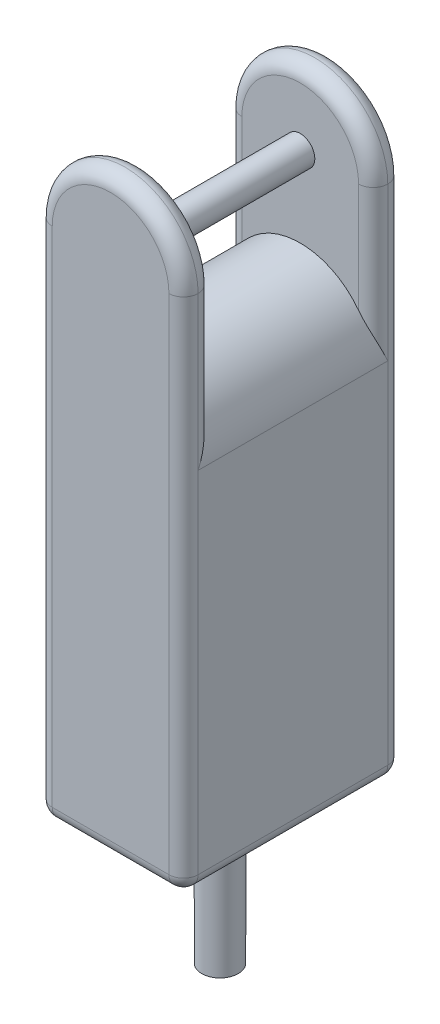
ISO-10303-21;
HEADER;
FILE_DESCRIPTION(('STEP AP214'),'2;1');
FILE_NAME('part.step','',(''),(''),'','','');
FILE_SCHEMA(('AUTOMOTIVE_DESIGN { 1 0 10303 214 1 1 1 1 }'));
ENDSEC;
DATA;
#1=APPLICATION_CONTEXT('core data for automotive mechanical design processes');
#2=APPLICATION_PROTOCOL_DEFINITION('international standard','automotive_design',2000,#1);
#3=PRODUCT_CONTEXT('',#1,'mechanical');
#4=PRODUCT('Part','Part','',(#3));
#5=PRODUCT_RELATED_PRODUCT_CATEGORY('part','',(#4));
#6=PRODUCT_DEFINITION_FORMATION('','',#4);
#7=PRODUCT_DEFINITION_CONTEXT('part definition',#1,'design');
#8=PRODUCT_DEFINITION('design','',#6,#7);
#9=PRODUCT_DEFINITION_SHAPE('','',#8);
#10=(LENGTH_UNIT() NAMED_UNIT(*) SI_UNIT(.MILLI.,.METRE.));
#11=(NAMED_UNIT(*) PLANE_ANGLE_UNIT() SI_UNIT($,.RADIAN.));
#12=(NAMED_UNIT(*) SI_UNIT($,.STERADIAN.) SOLID_ANGLE_UNIT());
#13=UNCERTAINTY_MEASURE_WITH_UNIT(LENGTH_MEASURE(1.E-05),#10,'distance_accuracy_value','');
#14=(GEOMETRIC_REPRESENTATION_CONTEXT(3) GLOBAL_UNCERTAINTY_ASSIGNED_CONTEXT((#13)) GLOBAL_UNIT_ASSIGNED_CONTEXT((#10,
#11,#12)) REPRESENTATION_CONTEXT('',''));
#15=CARTESIAN_POINT('',(0.,0.,0.));
#16=DIRECTION('',(0.,0.,1.));
#17=DIRECTION('',(1.,0.,0.));
#18=AXIS2_PLACEMENT_3D('',#15,#16,#17);
#19=CARTESIAN_POINT('',(0.,100.,75.));
#20=DIRECTION('',(0.,0.,1.));
#21=DIRECTION('',(1.,0.,0.));
#22=AXIS2_PLACEMENT_3D('',#19,#20,#21);
#23=CYLINDRICAL_SURFACE('',#22,50.);
#24=DIRECTION('',(0.,0.,-1.));
#25=VECTOR('',#24,1.);
#26=CARTESIAN_POINT('',(-50.,100.,75.));
#27=LINE('',#26,#25);
#28=CARTESIAN_POINT('',(-50.,100.,65.));
#29=VERTEX_POINT('',#28);
#30=CARTESIAN_POINT('',(-50.,100.,-65.));
#31=VERTEX_POINT('',#30);
#32=EDGE_CURVE('E60',#29,#31,#27,.T.);
#33=ORIENTED_EDGE('',*,*,#32,.F.);
#34=CARTESIAN_POINT('',(-40.,130.,55.));
#35=CARTESIAN_POINT('',(-40.2364212774072,129.684786910664,55.0000247644638));
#36=CARTESIAN_POINT('',(-40.4690638048453,129.366819453699,55.0083830572767));
#37=CARTESIAN_POINT('',(-40.9263571522265,128.726084135229,55.0403563236854));
#38=CARTESIAN_POINT('',(-41.151010475496,128.403317823152,55.0639664730447));
#39=CARTESIAN_POINT('',(-41.5916337278877,127.754093357433,55.124978455447));
#40=CARTESIAN_POINT('',(-41.8076189336004,127.427643126663,55.1623547263196));
#41=CARTESIAN_POINT('',(-42.2311358576086,126.770951810381,55.249678055568));
#42=CARTESIAN_POINT('',(-42.4386668232712,126.440710390702,55.29962623032));
#43=CARTESIAN_POINT('',(-43.0455248630893,125.449558439071,55.4658495892976));
#44=CARTESIAN_POINT('',(-43.4322125137611,124.783652235629,55.5989653259786));
#45=CARTESIAN_POINT('',(-44.1712946133565,123.441087677286,55.9027461200883));
#46=CARTESIAN_POINT('',(-44.5236663022692,122.764422527934,56.0734358570424));
#47=CARTESIAN_POINT('',(-45.1331272117013,121.526415645848,56.4122497773054));
#48=CARTESIAN_POINT('',(-45.3959012747771,120.966437615142,56.5752148680001));
#49=CARTESIAN_POINT('',(-45.8986325520335,119.841748982089,56.9192252917295));
#50=CARTESIAN_POINT('',(-46.1385870160457,119.277037818217,57.1002727986406));
#51=CARTESIAN_POINT('',(-46.5959901001086,118.143520797697,57.4779716047457));
#52=CARTESIAN_POINT('',(-46.8134314207902,117.574713676565,57.6746279284572));
#53=CARTESIAN_POINT('',(-47.2260092335059,116.433867614426,58.0812818543171));
#54=CARTESIAN_POINT('',(-47.4211464659329,115.861828781358,58.2912790132509));
#55=CARTESIAN_POINT('',(-47.9750211085314,114.137162656724,58.9400143561285));
#56=CARTESIAN_POINT('',(-48.300526187337,112.980204826719,59.3960635352867));
#57=CARTESIAN_POINT('',(-48.865183674321,110.65927120511,60.340486506057));
#58=CARTESIAN_POINT('',(-49.1043636833202,109.495297777844,60.8288499066022));
#59=CARTESIAN_POINT('',(-49.5342640933657,106.950593308146,61.9178011133303));
#60=CARTESIAN_POINT('',(-49.7083056259627,105.568871236734,62.5226677812744));
#61=CARTESIAN_POINT('',(-49.9404808377763,102.804859529371,63.7456847547993));
#62=CARTESIAN_POINT('',(-49.9988554482622,101.422577084548,64.3638047317607));
#63=CARTESIAN_POINT('',(-49.9999944414208,100.027216502059,64.9878284110037));
#64=CARTESIAN_POINT('',(-49.999999996868,100.013608224242,64.993914217884));
#65=CARTESIAN_POINT('',(-50.,100.,65.));
#66=B_SPLINE_CURVE_WITH_KNOTS('',3,(#34,#35,#36,#37,#38,#39,#40,#41,#42,#43,#44,#45,#46,#47,#48,
#49,#50,#51,#52,#53,#54,#55,#56,#57,#58,#59,#60,#61,#62,#63,#64,#65),.UNSPECIFIED.,.F.,.F.,(4,2,
2,2,2,2,2,2,2,2,2,2,2,2,2,4),(0.,1.18186087965503,2.36334811388144,3.54265242723163,
4.72206149894013,7.06431157017798,9.40810470368832,11.3264269148613,13.2449800258519,
15.1641532483593,17.0832627446499,20.93574334731,24.7869910981302,29.3373633474868,
33.8782472808731,33.9229686435293),.UNSPECIFIED.);
#67=CARTESIAN_POINT('',(-40.,130.,55.));
#68=VERTEX_POINT('',#67);
#69=EDGE_CURVE('E53',#29,#68,#66,.F.);
#70=ORIENTED_EDGE('',*,*,#69,.T.);
#71=CARTESIAN_POINT('',(0.,100.,55.));
#72=DIRECTION('',(0.,0.,-1.));
#73=DIRECTION('',(-1.,0.,0.));
#74=AXIS2_PLACEMENT_3D('',#71,#72,#73);
#75=CIRCLE('',#74,50.);
#76=CARTESIAN_POINT('',(40.,130.,55.));
#77=VERTEX_POINT('',#76);
#78=EDGE_CURVE('E514',#77,#68,#75,.F.);
#79=ORIENTED_EDGE('',*,*,#78,.F.);
#80=CARTESIAN_POINT('',(40.,130.,55.));
#81=CARTESIAN_POINT('',(40.2364212774066,129.684786910664,55.0000247644638));
#82=CARTESIAN_POINT('',(40.469063804844,129.366819453701,55.0083830572766));
#83=CARTESIAN_POINT('',(40.926357152224,128.726084135232,55.0403563236851));
#84=CARTESIAN_POINT('',(41.1510104754928,128.403317823156,55.0639664730443));
#85=CARTESIAN_POINT('',(41.5916337278834,127.75409335744,55.1249784554463));
#86=CARTESIAN_POINT('',(41.8076189335954,127.427643126671,55.1623547263187));
#87=CARTESIAN_POINT('',(42.2311358576025,126.770951810391,55.2496780555666));
#88=CARTESIAN_POINT('',(42.4386668232646,126.440710390713,55.2996262303184));
#89=CARTESIAN_POINT('',(43.0455248630835,125.449558439081,55.4658495892957));
#90=CARTESIAN_POINT('',(43.4322125137566,124.783652235637,55.5989653259769));
#91=CARTESIAN_POINT('',(44.1712946133544,123.44108767729,55.9027461200873));
#92=CARTESIAN_POINT('',(44.5236663022682,122.764422527936,56.0734358570419));
#93=CARTESIAN_POINT('',(45.1331272117017,121.526415645848,56.4122497773056));
#94=CARTESIAN_POINT('',(45.3959012747777,120.96643761514,56.5752148680006));
#95=CARTESIAN_POINT('',(45.8986325520347,119.841748982086,56.9192252917304));
#96=CARTESIAN_POINT('',(46.1385870160472,119.277037818213,57.1002727986418));
#97=CARTESIAN_POINT('',(46.5959901001106,118.143520797692,57.4779716047474));
#98=CARTESIAN_POINT('',(46.8134314207923,117.574713676559,57.6746279284591));
#99=CARTESIAN_POINT('',(47.2260092335083,116.433867614419,58.0812818543196));
#100=CARTESIAN_POINT('',(47.4211464659354,115.861828781351,58.2912790132539));
#101=CARTESIAN_POINT('',(47.9750211085333,114.137162656717,58.9400143561304));
#102=CARTESIAN_POINT('',(48.3005261873383,112.980204826712,59.3960635352854));
#103=CARTESIAN_POINT('',(48.8651836743215,110.65927120511,60.3404865060613));
#104=CARTESIAN_POINT('',(49.1043636833204,109.495297777849,60.8288499066155));
#105=CARTESIAN_POINT('',(49.5342640933656,106.95059330814,61.9178011133151));
#106=CARTESIAN_POINT('',(49.7083056259626,105.568871236707,62.5226677812129));
#107=CARTESIAN_POINT('',(49.9404808377764,102.804859529399,63.7456847548603));
#108=CARTESIAN_POINT('',(49.9988554482625,101.422577084651,64.36380473199));
#109=CARTESIAN_POINT('',(49.9999944414209,100.027216502061,64.9878284110082));
#110=CARTESIAN_POINT('',(49.9999999968681,100.013608224243,64.9939142178863));
#111=CARTESIAN_POINT('',(50.,100.,65.));
#112=B_SPLINE_CURVE_WITH_KNOTS('',3,(#80,#81,#82,#83,#84,#85,#86,#87,#88,#89,#90,#91,#92,#93,
#94,#95,#96,#97,#98,#99,#100,#101,#102,#103,#104,#105,#106,#107,#108,#109,#110,#111),
.UNSPECIFIED.,.F.,.F.,(4,2,2,2,2,2,2,2,2,2,2,2,2,2,2,4),(0.,1.18186087965163,2.36334811387468,
3.5426524272213,4.72206149892624,7.06431157017088,9.4081047036883,11.3264269148637,
13.2449800258567,15.164153248366,17.0832627446587,20.9357433473138,24.7869910981301,
29.3373633474861,33.8782472808732,33.9229686435293),.UNSPECIFIED.);
#113=CARTESIAN_POINT('',(50.,100.,65.));
#114=VERTEX_POINT('',#113);
#115=EDGE_CURVE('E318',#77,#114,#112,.T.);
#116=ORIENTED_EDGE('',*,*,#115,.T.);
#117=DIRECTION('',(0.,0.,1.));
#118=VECTOR('',#117,1.);
#119=CARTESIAN_POINT('',(50.,100.,75.));
#120=LINE('',#119,#118);
#121=CARTESIAN_POINT('',(50.,100.,-65.));
#122=VERTEX_POINT('',#121);
#123=EDGE_CURVE('E405',#122,#114,#120,.T.);
#124=ORIENTED_EDGE('',*,*,#123,.F.);
#125=CARTESIAN_POINT('',(40.,130.,-55.));
#126=CARTESIAN_POINT('',(40.236421277408,129.684786910662,-55.0000247644639));
#127=CARTESIAN_POINT('',(40.4690638048468,129.366819453697,-55.0083830572768));
#128=CARTESIAN_POINT('',(40.9263571522295,128.726084135224,-55.0403563236856));
#129=CARTESIAN_POINT('',(41.1510104754996,128.403317823146,-55.0639664730451));
#130=CARTESIAN_POINT('',(41.5916337278928,127.754093357426,-55.1249784554479));
#131=CARTESIAN_POINT('',(41.8076189336061,127.427643126654,-55.1623547263206));
#132=CARTESIAN_POINT('',(42.2311358576156,126.770951810371,-55.2496780555696));
#133=CARTESIAN_POINT('',(42.4386668232787,126.44071039069,-55.2996262303219));
#134=CARTESIAN_POINT('',(43.0455248630959,125.44955843906,-55.4658495892998));
#135=CARTESIAN_POINT('',(43.4322125137662,124.78365223562,-55.5989653259805));
#136=CARTESIAN_POINT('',(44.171294613359,123.441087677281,-55.9027461200895));
#137=CARTESIAN_POINT('',(44.5236663022703,122.764422527932,-56.0734358570431));
#138=CARTESIAN_POINT('',(45.133127211701,121.526415645849,-56.4122497773052));
#139=CARTESIAN_POINT('',(45.3959012747763,120.966437615143,-56.5752148679997));
#140=CARTESIAN_POINT('',(45.8986325520321,119.841748982092,-56.9192252917285));
#141=CARTESIAN_POINT('',(46.138587016044,119.277037818221,-57.1002727986393));
#142=CARTESIAN_POINT('',(46.5959901001065,118.143520797703,-57.4779716047439));
#143=CARTESIAN_POINT('',(46.8134314207879,117.574713676571,-57.6746279284552));
#144=CARTESIAN_POINT('',(47.2260092335033,116.433867614433,-58.0812818543143));
#145=CARTESIAN_POINT('',(47.4211464659302,115.861828781366,-58.2912790132476));
#146=CARTESIAN_POINT('',(47.9750211085293,114.137162656731,-58.9400143561263));
#147=CARTESIAN_POINT('',(48.3005261873356,112.980204826726,-59.3960635352883));
#148=CARTESIAN_POINT('',(48.8651836743205,110.659271205111,-60.3404865060522));
#149=CARTESIAN_POINT('',(49.10436368332,109.495297777839,-60.8288499065872));
#150=CARTESIAN_POINT('',(49.5342640933657,106.950593308154,-61.9178011133475));
#151=CARTESIAN_POINT('',(49.7083056259628,105.568871236764,-62.5226677813438));
#152=CARTESIAN_POINT('',(49.9404808377763,102.804859529339,-63.7456847547304));
#153=CARTESIAN_POINT('',(49.998855448262,101.422577084432,-64.3638047315018));
#154=CARTESIAN_POINT('',(49.9999944414209,100.027216502057,-64.9878284109987));
#155=CARTESIAN_POINT('',(49.9999999968681,100.013608224241,-64.9939142178815));
#156=CARTESIAN_POINT('',(50.,100.,-65.));
#157=B_SPLINE_CURVE_WITH_KNOTS('',3,(#125,#126,#127,#128,#129,#130,#131,#132,#133,#134,#135,
#136,#137,#138,#139,#140,#141,#142,#143,#144,#145,#146,#147,#148,#149,#150,#151,#152,#153,#154,
#155,#156),.UNSPECIFIED.,.F.,.F.,(4,2,2,2,2,2,2,2,2,2,2,2,2,2,2,4),(0.,1.18186087965882,
2.36334811388908,3.5426524272433,4.72206149895579,7.06431157018598,9.40810470368835,
11.3264269148586,13.2449800258465,15.1641532483516,17.0832627446399,20.9357433473057,
24.7869910981302,29.3373633474877,33.8782472808732,33.9229686435293),.UNSPECIFIED.);
#158=CARTESIAN_POINT('',(40.,130.,-55.));
#159=VERTEX_POINT('',#158);
#160=EDGE_CURVE('E328',#122,#159,#157,.F.);
#161=ORIENTED_EDGE('',*,*,#160,.T.);
#162=CARTESIAN_POINT('',(0.,100.,-55.));
#163=DIRECTION('',(0.,0.,1.));
#164=DIRECTION('',(1.,0.,0.));
#165=AXIS2_PLACEMENT_3D('',#162,#163,#164);
#166=CIRCLE('',#165,50.);
#167=CARTESIAN_POINT('',(-40.,130.,-55.));
#168=VERTEX_POINT('',#167);
#169=EDGE_CURVE('E517',#168,#159,#166,.F.);
#170=ORIENTED_EDGE('',*,*,#169,.F.);
#171=CARTESIAN_POINT('',(-40.,130.,-55.));
#172=CARTESIAN_POINT('',(-40.2364212774067,129.684786910664,-55.0000247644639));
#173=CARTESIAN_POINT('',(-40.4690638048442,129.366819453701,-55.0083830572767));
#174=CARTESIAN_POINT('',(-40.9263571522244,128.726084135232,-55.0403563236852));
#175=CARTESIAN_POINT('',(-41.1510104754933,128.403317823155,-55.0639664730444));
#176=CARTESIAN_POINT('',(-41.5916337278841,127.754093357439,-55.1249784554465));
#177=CARTESIAN_POINT('',(-41.8076189335963,127.427643126669,-55.1623547263188));
#178=CARTESIAN_POINT('',(-42.2311358576036,126.770951810389,-55.2496780555668));
#179=CARTESIAN_POINT('',(-42.4386668232657,126.440710390711,-55.2996262303187));
#180=CARTESIAN_POINT('',(-43.0455248630845,125.44955843908,-55.4658495892961));
#181=CARTESIAN_POINT('',(-43.4322125137573,124.783652235636,-55.5989653259772));
#182=CARTESIAN_POINT('',(-44.1712946133548,123.441087677289,-55.9027461200875));
#183=CARTESIAN_POINT('',(-44.5236663022683,122.764422527936,-56.073435857042));
#184=CARTESIAN_POINT('',(-45.1331272117016,121.526415645848,-56.4122497773056));
#185=CARTESIAN_POINT('',(-45.3959012747776,120.966437615141,-56.5752148680005));
#186=CARTESIAN_POINT('',(-45.8986325520345,119.841748982086,-56.9192252917303));
#187=CARTESIAN_POINT('',(-46.1385870160469,119.277037818214,-57.1002727986416));
#188=CARTESIAN_POINT('',(-46.5959901001102,118.143520797693,-57.4779716047471));
#189=CARTESIAN_POINT('',(-46.8134314207919,117.57471367656,-57.6746279284588));
#190=CARTESIAN_POINT('',(-47.2260092335079,116.43386761442,-58.0812818543191));
#191=CARTESIAN_POINT('',(-47.4211464659349,115.861828781352,-58.2912790132534));
#192=CARTESIAN_POINT('',(-47.9750211085329,114.137162656718,-58.94001435613));
#193=CARTESIAN_POINT('',(-48.3005261873381,112.980204826713,-59.3960635352856));
#194=CARTESIAN_POINT('',(-48.8651836743214,110.65927120511,-60.3404865060606));
#195=CARTESIAN_POINT('',(-49.1043636833204,109.495297777848,-60.8288499066132));
#196=CARTESIAN_POINT('',(-49.5342640933656,106.950593308141,-61.9178011133178));
#197=CARTESIAN_POINT('',(-49.7083056259627,105.568871236712,-62.5226677812237));
#198=CARTESIAN_POINT('',(-49.9404808377763,102.804859529394,-63.7456847548497));
#199=CARTESIAN_POINT('',(-49.9988554482622,101.422577084633,-64.3638047319501));
#200=CARTESIAN_POINT('',(-49.9999944414208,100.027216502061,-64.9878284110074));
#201=CARTESIAN_POINT('',(-49.999999996868,100.013608224243,-64.9939142178859));
#202=CARTESIAN_POINT('',(-50.,100.,-65.));
#203=B_SPLINE_CURVE_WITH_KNOTS('',3,(#171,#172,#173,#174,#175,#176,#177,#178,#179,#180,#181,
#182,#183,#184,#185,#186,#187,#188,#189,#190,#191,#192,#193,#194,#195,#196,#197,#198,#199,#200,
#201,#202),.UNSPECIFIED.,.F.,.F.,(4,2,2,2,2,2,2,2,2,2,2,2,2,2,2,4),(0.,1.1818608796522,
2.36334811387585,3.54265242722312,4.72206149892863,7.06431157017211,9.40810470368831,
11.3264269148633,13.2449800258559,15.1641532483649,17.0832627446571,20.9357433473131,
24.7869910981301,29.3373633474862,33.8782472808731,33.9229686435294),.UNSPECIFIED.);
#204=EDGE_CURVE('E11',#168,#31,#203,.T.);
#205=ORIENTED_EDGE('',*,*,#204,.T.);
#206=EDGE_LOOP('',(#33,#70,#79,#116,#124,#161,#170,#205));
#207=FACE_BOUND('',#206,.T.);
#208=ADVANCED_FACE('F42',(#207),#23,.T.);
#209=CARTESIAN_POINT('',(50.,0.,75.));
#210=DIRECTION('',(1.,0.,0.));
#211=DIRECTION('',(0.,1.,0.));
#212=AXIS2_PLACEMENT_3D('',#209,#210,#211);
#213=PLANE('',#212);
#214=ORIENTED_EDGE('',*,*,#123,.T.);
#215=DIRECTION('',(0.,-1.,0.));
#216=VECTOR('',#215,1.);
#217=CARTESIAN_POINT('',(50.,0.,65.));
#218=LINE('',#217,#216);
#219=CARTESIAN_POINT('',(50.,-140.,65.));
#220=VERTEX_POINT('',#219);
#221=EDGE_CURVE('E231',#114,#220,#218,.T.);
#222=ORIENTED_EDGE('',*,*,#221,.T.);
#223=DIRECTION('',(0.,0.,-1.));
#224=VECTOR('',#223,1.);
#225=CARTESIAN_POINT('',(50.,-140.,-75.));
#226=LINE('',#225,#224);
#227=CARTESIAN_POINT('',(50.,-140.,-65.));
#228=VERTEX_POINT('',#227);
#229=EDGE_CURVE('E236',#220,#228,#226,.T.);
#230=ORIENTED_EDGE('',*,*,#229,.T.);
#231=DIRECTION('',(0.,-1.,0.));
#232=VECTOR('',#231,1.);
#233=CARTESIAN_POINT('',(50.,205.,-65.));
#234=LINE('',#233,#232);
#235=EDGE_CURVE('E240',#228,#122,#234,.F.);
#236=ORIENTED_EDGE('',*,*,#235,.T.);
#237=EDGE_LOOP('',(#214,#222,#230,#236));
#238=FACE_BOUND('',#237,.T.);
#239=ADVANCED_FACE('F346',(#238),#213,.T.);
#240=CARTESIAN_POINT('',(-50.,0.,75.));
#241=DIRECTION('',(1.,0.,0.));
#242=DIRECTION('',(0.,1.,0.));
#243=AXIS2_PLACEMENT_3D('',#240,#241,#242);
#244=PLANE('',#243);
#245=DIRECTION('',(0.,-1.,0.));
#246=VECTOR('',#245,1.);
#247=CARTESIAN_POINT('',(-50.,205.,65.));
#248=LINE('',#247,#246);
#249=CARTESIAN_POINT('',(-50.,-140.,65.));
#250=VERTEX_POINT('',#249);
#251=EDGE_CURVE('E501',#250,#29,#248,.F.);
#252=ORIENTED_EDGE('',*,*,#251,.T.);
#253=ORIENTED_EDGE('',*,*,#32,.T.);
#254=DIRECTION('',(0.,-1.,0.));
#255=VECTOR('',#254,1.);
#256=CARTESIAN_POINT('',(-50.,0.,-65.));
#257=LINE('',#256,#255);
#258=CARTESIAN_POINT('',(-50.,-140.,-65.));
#259=VERTEX_POINT('',#258);
#260=EDGE_CURVE('E177',#31,#259,#257,.T.);
#261=ORIENTED_EDGE('',*,*,#260,.T.);
#262=DIRECTION('',(0.,0.,-1.));
#263=VECTOR('',#262,1.);
#264=CARTESIAN_POINT('',(-50.,-140.,75.));
#265=LINE('',#264,#263);
#266=EDGE_CURVE('E504',#259,#250,#265,.F.);
#267=ORIENTED_EDGE('',*,*,#266,.T.);
#268=EDGE_LOOP('',(#252,#253,#261,#267));
#269=FACE_BOUND('',#268,.T.);
#270=ADVANCED_FACE('F494',(#269),#244,.F.);
#271=CARTESIAN_POINT('',(0.,-150.,75.));
#272=DIRECTION('',(0.,1.,0.));
#273=DIRECTION('',(0.,0.,1.));
#274=AXIS2_PLACEMENT_3D('',#271,#272,#273);
#275=PLANE('',#274);
#276=DIRECTION('',(1.,0.,0.));
#277=VECTOR('',#276,1.);
#278=CARTESIAN_POINT('',(-50.,-150.,65.));
#279=LINE('',#278,#277);
#280=CARTESIAN_POINT('',(40.,-150.,65.));
#281=VERTEX_POINT('',#280);
#282=CARTESIAN_POINT('',(-40.,-150.,65.));
#283=VERTEX_POINT('',#282);
#284=EDGE_CURVE('E224',#281,#283,#279,.F.);
#285=ORIENTED_EDGE('',*,*,#284,.T.);
#286=DIRECTION('',(0.,0.,-1.));
#287=VECTOR('',#286,1.);
#288=CARTESIAN_POINT('',(-40.,-150.,75.));
#289=LINE('',#288,#287);
#290=CARTESIAN_POINT('',(-40.,-150.,-65.));
#291=VERTEX_POINT('',#290);
#292=EDGE_CURVE('E227',#283,#291,#289,.T.);
#293=ORIENTED_EDGE('',*,*,#292,.T.);
#294=DIRECTION('',(1.,0.,0.));
#295=VECTOR('',#294,1.);
#296=CARTESIAN_POINT('',(0.,-150.,-65.));
#297=LINE('',#296,#295);
#298=CARTESIAN_POINT('',(40.,-150.,-65.));
#299=VERTEX_POINT('',#298);
#300=EDGE_CURVE('E218',#291,#299,#297,.T.);
#301=ORIENTED_EDGE('',*,*,#300,.T.);
#302=DIRECTION('',(0.,0.,-1.));
#303=VECTOR('',#302,1.);
#304=CARTESIAN_POINT('',(40.,-150.,75.));
#305=LINE('',#304,#303);
#306=EDGE_CURVE('E221',#299,#281,#305,.F.);
#307=ORIENTED_EDGE('',*,*,#306,.T.);
#308=EDGE_LOOP('',(#285,#293,#301,#307));
#309=FACE_BOUND('',#308,.T.);
#310=CARTESIAN_POINT('',(0.,-150.,0.));
#311=DIRECTION('',(0.,1.,0.));
#312=DIRECTION('',(0.,0.,1.));
#313=AXIS2_PLACEMENT_3D('',#310,#311,#312);
#314=CIRCLE('',#313,12.5);
#315=CARTESIAN_POINT('',(0.,-150.,12.5));
#316=VERTEX_POINT('',#315);
#317=EDGE_CURVE('E739',#316,#316,#314,.F.);
#318=ORIENTED_EDGE('',*,*,#317,.F.);
#319=EDGE_LOOP('',(#318));
#320=FACE_BOUND('',#319,.T.);
#321=ADVANCED_FACE('F488',(#309,#320),#275,.F.);
#322=CARTESIAN_POINT('',(0.,0.,75.));
#323=DIRECTION('',(0.,0.,1.));
#324=DIRECTION('',(1.,0.,0.));
#325=AXIS2_PLACEMENT_3D('',#322,#323,#324);
#326=PLANE('',#325);
#327=CARTESIAN_POINT('',(0.,205.,75.));
#328=DIRECTION('',(0.,0.,1.));
#329=DIRECTION('',(1.,0.,0.));
#330=AXIS2_PLACEMENT_3D('',#327,#328,#329);
#331=CIRCLE('',#330,40.);
#332=CARTESIAN_POINT('',(40.,205.,75.));
#333=VERTEX_POINT('',#332);
#334=CARTESIAN_POINT('',(-40.,205.,75.));
#335=VERTEX_POINT('',#334);
#336=EDGE_CURVE('E207',#333,#335,#331,.T.);
#337=ORIENTED_EDGE('',*,*,#336,.T.);
#338=DIRECTION('',(0.,-1.,0.));
#339=VECTOR('',#338,1.);
#340=CARTESIAN_POINT('',(-40.,-150.,75.));
#341=LINE('',#340,#339);
#342=CARTESIAN_POINT('',(-40.,-140.,75.));
#343=VERTEX_POINT('',#342);
#344=EDGE_CURVE('E210',#335,#343,#341,.T.);
#345=ORIENTED_EDGE('',*,*,#344,.T.);
#346=DIRECTION('',(1.,0.,0.));
#347=VECTOR('',#346,1.);
#348=CARTESIAN_POINT('',(50.,-140.,75.));
#349=LINE('',#348,#347);
#350=CARTESIAN_POINT('',(40.,-140.,75.));
#351=VERTEX_POINT('',#350);
#352=EDGE_CURVE('E200',#343,#351,#349,.T.);
#353=ORIENTED_EDGE('',*,*,#352,.T.);
#354=DIRECTION('',(0.,-1.,0.));
#355=VECTOR('',#354,1.);
#356=CARTESIAN_POINT('',(40.,0.,75.));
#357=LINE('',#356,#355);
#358=EDGE_CURVE('E195',#351,#333,#357,.F.);
#359=ORIENTED_EDGE('',*,*,#358,.T.);
#360=EDGE_LOOP('',(#337,#345,#353,#359));
#361=FACE_BOUND('',#360,.T.);
#362=ADVANCED_FACE('F485',(#361),#326,.T.);
#363=CARTESIAN_POINT('',(0.,0.,-75.));
#364=DIRECTION('',(0.,0.,1.));
#365=DIRECTION('',(1.,0.,0.));
#366=AXIS2_PLACEMENT_3D('',#363,#364,#365);
#367=PLANE('',#366);
#368=DIRECTION('',(1.,0.,0.));
#369=VECTOR('',#368,1.);
#370=CARTESIAN_POINT('',(0.,-140.,-75.));
#371=LINE('',#370,#369);
#372=CARTESIAN_POINT('',(40.,-140.,-75.));
#373=VERTEX_POINT('',#372);
#374=CARTESIAN_POINT('',(-40.,-140.,-75.));
#375=VERTEX_POINT('',#374);
#376=EDGE_CURVE('E528',#373,#375,#371,.F.);
#377=ORIENTED_EDGE('',*,*,#376,.T.);
#378=DIRECTION('',(0.,-1.,0.));
#379=VECTOR('',#378,1.);
#380=CARTESIAN_POINT('',(-40.,0.,-75.));
#381=LINE('',#380,#379);
#382=CARTESIAN_POINT('',(-40.,205.,-75.));
#383=VERTEX_POINT('',#382);
#384=EDGE_CURVE('E196',#375,#383,#381,.F.);
#385=ORIENTED_EDGE('',*,*,#384,.T.);
#386=CARTESIAN_POINT('',(0.,205.,-75.));
#387=DIRECTION('',(0.,0.,1.));
#388=DIRECTION('',(1.,0.,0.));
#389=AXIS2_PLACEMENT_3D('',#386,#387,#388);
#390=CIRCLE('',#389,40.);
#391=CARTESIAN_POINT('',(40.,205.,-75.));
#392=VERTEX_POINT('',#391);
#393=EDGE_CURVE('E163',#383,#392,#390,.F.);
#394=ORIENTED_EDGE('',*,*,#393,.T.);
#395=DIRECTION('',(0.,-1.,0.));
#396=VECTOR('',#395,1.);
#397=CARTESIAN_POINT('',(40.,-150.,-75.));
#398=LINE('',#397,#396);
#399=EDGE_CURVE('E181',#392,#373,#398,.T.);
#400=ORIENTED_EDGE('',*,*,#399,.T.);
#401=EDGE_LOOP('',(#377,#385,#394,#400));
#402=FACE_BOUND('',#401,.T.);
#403=ADVANCED_FACE('F483',(#402),#367,.F.);
#404=CARTESIAN_POINT('',(-50.,255.001,-55.));
#405=DIRECTION('',(0.,0.,1.));
#406=DIRECTION('',(1.,0.,0.));
#407=AXIS2_PLACEMENT_3D('',#404,#405,#406);
#408=PLANE('',#407);
#409=CARTESIAN_POINT('',(0.,205.,-55.));
#410=DIRECTION('',(0.,0.,1.));
#411=DIRECTION('',(1.,0.,0.));
#412=AXIS2_PLACEMENT_3D('',#409,#410,#411);
#413=CIRCLE('',#412,10.);
#414=CARTESIAN_POINT('',(9.99999999999999,205.,-55.));
#415=VERTEX_POINT('',#414);
#416=EDGE_CURVE('E748',#415,#415,#413,.T.);
#417=ORIENTED_EDGE('',*,*,#416,.F.);
#418=EDGE_LOOP('',(#417));
#419=FACE_BOUND('',#418,.T.);
#420=ORIENTED_EDGE('',*,*,#169,.T.);
#421=DIRECTION('',(0.,-1.,0.));
#422=VECTOR('',#421,1.);
#423=CARTESIAN_POINT('',(40.,255.001,-55.));
#424=LINE('',#423,#422);
#425=CARTESIAN_POINT('',(40.,205.,-55.));
#426=VERTEX_POINT('',#425);
#427=EDGE_CURVE('E315',#159,#426,#424,.F.);
#428=ORIENTED_EDGE('',*,*,#427,.T.);
#429=CARTESIAN_POINT('',(0.,205.,-55.));
#430=DIRECTION('',(0.,0.,1.));
#431=DIRECTION('',(1.,0.,0.));
#432=AXIS2_PLACEMENT_3D('',#429,#430,#431);
#433=CIRCLE('',#432,40.);
#434=CARTESIAN_POINT('',(-40.,205.,-55.));
#435=VERTEX_POINT('',#434);
#436=EDGE_CURVE('E312',#426,#435,#433,.T.);
#437=ORIENTED_EDGE('',*,*,#436,.T.);
#438=DIRECTION('',(0.,-1.,0.));
#439=VECTOR('',#438,1.);
#440=CARTESIAN_POINT('',(-40.,100.,-55.));
#441=LINE('',#440,#439);
#442=EDGE_CURVE('E185',#435,#168,#441,.T.);
#443=ORIENTED_EDGE('',*,*,#442,.T.);
#444=EDGE_LOOP('',(#420,#428,#437,#443));
#445=FACE_BOUND('',#444,.T.);
#446=ADVANCED_FACE('F479',(#419,#445),#408,.T.);
#447=CARTESIAN_POINT('',(-50.,255.001,55.));
#448=DIRECTION('',(0.,0.,-1.));
#449=DIRECTION('',(-1.,0.,0.));
#450=AXIS2_PLACEMENT_3D('',#447,#448,#449);
#451=PLANE('',#450);
#452=CARTESIAN_POINT('',(0.,205.,55.));
#453=DIRECTION('',(0.,0.,-1.));
#454=DIRECTION('',(-1.,0.,0.));
#455=AXIS2_PLACEMENT_3D('',#452,#453,#454);
#456=CIRCLE('',#455,10.);
#457=CARTESIAN_POINT('',(-10.,205.,55.));
#458=VERTEX_POINT('',#457);
#459=EDGE_CURVE('E742',#458,#458,#456,.T.);
#460=ORIENTED_EDGE('',*,*,#459,.F.);
#461=EDGE_LOOP('',(#460));
#462=FACE_BOUND('',#461,.T.);
#463=CARTESIAN_POINT('',(0.,205.,55.));
#464=DIRECTION('',(0.,0.,-1.));
#465=DIRECTION('',(-1.,0.,0.));
#466=AXIS2_PLACEMENT_3D('',#463,#464,#465);
#467=CIRCLE('',#466,40.);
#468=CARTESIAN_POINT('',(-40.,205.,55.));
#469=VERTEX_POINT('',#468);
#470=CARTESIAN_POINT('',(40.,205.,55.));
#471=VERTEX_POINT('',#470);
#472=EDGE_CURVE('E303',#469,#471,#467,.T.);
#473=ORIENTED_EDGE('',*,*,#472,.T.);
#474=DIRECTION('',(0.,-1.,0.));
#475=VECTOR('',#474,1.);
#476=CARTESIAN_POINT('',(40.,255.001,55.));
#477=LINE('',#476,#475);
#478=EDGE_CURVE('E306',#471,#77,#477,.T.);
#479=ORIENTED_EDGE('',*,*,#478,.T.);
#480=ORIENTED_EDGE('',*,*,#78,.T.);
#481=DIRECTION('',(0.,-1.,0.));
#482=VECTOR('',#481,1.);
#483=CARTESIAN_POINT('',(-40.,205.,55.));
#484=LINE('',#483,#482);
#485=EDGE_CURVE('E244',#68,#469,#484,.F.);
#486=ORIENTED_EDGE('',*,*,#485,.T.);
#487=EDGE_LOOP('',(#473,#479,#480,#486));
#488=FACE_BOUND('',#487,.T.);
#489=ADVANCED_FACE('F475',(#462,#488),#451,.T.);
#490=CARTESIAN_POINT('',(0.,205.,83.2842712474619));
#491=DIRECTION('',(0.,0.,-1.));
#492=DIRECTION('',(-1.,0.,0.));
#493=AXIS2_PLACEMENT_3D('',#490,#491,#492);
#494=CYLINDRICAL_SURFACE('',#493,10.);
#495=ORIENTED_EDGE('',*,*,#459,.T.);
#496=EDGE_LOOP('',(#495));
#497=FACE_BOUND('',#496,.T.);
#498=ORIENTED_EDGE('',*,*,#416,.T.);
#499=EDGE_LOOP('',(#498));
#500=FACE_BOUND('',#499,.T.);
#501=ADVANCED_FACE('F468',(#497,#500),#494,.T.);
#502=CARTESIAN_POINT('',(0.,-250.,0.));
#503=DIRECTION('',(0.,1.,0.));
#504=DIRECTION('',(0.,0.,1.));
#505=AXIS2_PLACEMENT_3D('',#502,#503,#504);
#506=CYLINDRICAL_SURFACE('',#505,12.5);
#507=CARTESIAN_POINT('',(0.,-250.,0.));
#508=DIRECTION('',(0.,-1.,0.));
#509=DIRECTION('',(0.,0.,-1.));
#510=AXIS2_PLACEMENT_3D('',#507,#508,#509);
#511=CIRCLE('',#510,12.5);
#512=CARTESIAN_POINT('',(0.,-250.,-12.5));
#513=VERTEX_POINT('',#512);
#514=EDGE_CURVE('E300',#513,#513,#511,.T.);
#515=ORIENTED_EDGE('',*,*,#514,.F.);
#516=EDGE_LOOP('',(#515));
#517=FACE_BOUND('',#516,.T.);
#518=ORIENTED_EDGE('',*,*,#317,.T.);
#519=EDGE_LOOP('',(#518));
#520=FACE_BOUND('',#519,.T.);
#521=ADVANCED_FACE('F462',(#517,#520),#506,.T.);
#522=CARTESIAN_POINT('',(0.,-250.,0.));
#523=DIRECTION('',(0.,-1.,0.));
#524=DIRECTION('',(0.,0.,-1.));
#525=AXIS2_PLACEMENT_3D('',#522,#523,#524);
#526=PLANE('',#525);
#527=ORIENTED_EDGE('',*,*,#514,.T.);
#528=EDGE_LOOP('',(#527));
#529=FACE_BOUND('',#528,.T.);
#530=ADVANCED_FACE('F458',(#529),#526,.T.);
#531=CARTESIAN_POINT('',(40.,0.,65.));
#532=DIRECTION('',(0.,-1.,0.));
#533=DIRECTION('',(1.,0.,0.));
#534=AXIS2_PLACEMENT_3D('',#531,#532,#533);
#535=CYLINDRICAL_SURFACE('',#534,10.);
#536=CARTESIAN_POINT('',(40.,-140.,65.));
#537=DIRECTION('',(0.,-1.,0.));
#538=DIRECTION('',(0.,0.,-1.));
#539=AXIS2_PLACEMENT_3D('',#536,#537,#538);
#540=CIRCLE('',#539,10.);
#541=EDGE_CURVE('E292',#220,#351,#540,.T.);
#542=ORIENTED_EDGE('',*,*,#541,.F.);
#543=ORIENTED_EDGE('',*,*,#221,.F.);
#544=CARTESIAN_POINT('',(50.,205.,65.));
#545=VERTEX_POINT('',#544);
#546=EDGE_CURVE('E232',#545,#114,#218,.T.);
#547=ORIENTED_EDGE('',*,*,#546,.F.);
#548=CARTESIAN_POINT('',(40.,205.,65.));
#549=DIRECTION('',(0.,1.,0.));
#550=DIRECTION('',(0.,0.,1.));
#551=AXIS2_PLACEMENT_3D('',#548,#549,#550);
#552=CIRCLE('',#551,10.);
#553=EDGE_CURVE('E296',#333,#545,#552,.T.);
#554=ORIENTED_EDGE('',*,*,#553,.F.);
#555=ORIENTED_EDGE('',*,*,#358,.F.);
#556=EDGE_LOOP('',(#542,#543,#547,#554,#555));
#557=FACE_BOUND('',#556,.T.);
#558=ADVANCED_FACE('F409',(#557),#535,.T.);
#559=CARTESIAN_POINT('',(0.,205.,65.));
#560=DIRECTION('',(0.,0.,1.));
#561=DIRECTION('',(1.,0.,0.));
#562=AXIS2_PLACEMENT_3D('',#559,#560,#561);
#563=TOROIDAL_SURFACE('',#562,40.,10.);
#564=ORIENTED_EDGE('',*,*,#553,.T.);
#565=CARTESIAN_POINT('',(0.,205.,65.));
#566=DIRECTION('',(0.,0.,1.));
#567=DIRECTION('',(1.,0.,0.));
#568=AXIS2_PLACEMENT_3D('',#565,#566,#567);
#569=CIRCLE('',#568,50.);
#570=CARTESIAN_POINT('',(-50.,205.,65.));
#571=VERTEX_POINT('',#570);
#572=EDGE_CURVE('E214',#571,#545,#569,.F.);
#573=ORIENTED_EDGE('',*,*,#572,.F.);
#574=CARTESIAN_POINT('',(-40.,205.,65.));
#575=DIRECTION('',(0.,-1.,0.));
#576=DIRECTION('',(0.,0.,-1.));
#577=AXIS2_PLACEMENT_3D('',#574,#575,#576);
#578=CIRCLE('',#577,10.);
#579=EDGE_CURVE('E288',#335,#571,#578,.T.);
#580=ORIENTED_EDGE('',*,*,#579,.F.);
#581=ORIENTED_EDGE('',*,*,#336,.F.);
#582=EDGE_LOOP('',(#564,#573,#580,#581));
#583=FACE_BOUND('',#582,.T.);
#584=ADVANCED_FACE('F454',(#583),#563,.T.);
#585=CARTESIAN_POINT('',(40.,-140.,65.));
#586=DIRECTION('',(0.,0.,1.));
#587=DIRECTION('',(1.,0.,0.));
#588=AXIS2_PLACEMENT_3D('',#585,#586,#587);
#589=SPHERICAL_SURFACE('',#588,10.);
#590=CARTESIAN_POINT('',(40.,-140.,65.));
#591=DIRECTION('',(0.,0.,1.));
#592=DIRECTION('',(1.,0.,0.));
#593=AXIS2_PLACEMENT_3D('',#590,#591,#592);
#594=CIRCLE('',#593,10.);
#595=EDGE_CURVE('E280',#220,#281,#594,.F.);
#596=ORIENTED_EDGE('',*,*,#595,.F.);
#597=ORIENTED_EDGE('',*,*,#541,.T.);
#598=CARTESIAN_POINT('',(40.,-140.,65.));
#599=DIRECTION('',(1.,0.,0.));
#600=DIRECTION('',(0.,0.,-1.));
#601=AXIS2_PLACEMENT_3D('',#598,#599,#600);
#602=CIRCLE('',#601,10.);
#603=EDGE_CURVE('E284',#281,#351,#602,.F.);
#604=ORIENTED_EDGE('',*,*,#603,.F.);
#605=EDGE_LOOP('',(#596,#597,#604));
#606=FACE_BOUND('',#605,.T.);
#607=ADVANCED_FACE('F413',(#606),#589,.T.);
#608=CARTESIAN_POINT('',(-40.,0.,65.));
#609=DIRECTION('',(0.,1.,0.));
#610=DIRECTION('',(-1.,0.,0.));
#611=AXIS2_PLACEMENT_3D('',#608,#609,#610);
#612=CYLINDRICAL_SURFACE('',#611,10.);
#613=ORIENTED_EDGE('',*,*,#579,.T.);
#614=EDGE_CURVE('E507',#29,#571,#248,.F.);
#615=ORIENTED_EDGE('',*,*,#614,.F.);
#616=ORIENTED_EDGE('',*,*,#251,.F.);
#617=CARTESIAN_POINT('',(-40.,-140.,65.));
#618=DIRECTION('',(0.,-1.,0.));
#619=DIRECTION('',(0.,0.,-1.));
#620=AXIS2_PLACEMENT_3D('',#617,#618,#619);
#621=CIRCLE('',#620,10.);
#622=EDGE_CURVE('E276',#343,#250,#621,.T.);
#623=ORIENTED_EDGE('',*,*,#622,.F.);
#624=ORIENTED_EDGE('',*,*,#344,.F.);
#625=EDGE_LOOP('',(#613,#615,#616,#623,#624));
#626=FACE_BOUND('',#625,.T.);
#627=ADVANCED_FACE('F447',(#626),#612,.T.);
#628=CARTESIAN_POINT('',(0.,-140.,65.));
#629=DIRECTION('',(-1.,0.,0.));
#630=DIRECTION('',(0.,0.,1.));
#631=AXIS2_PLACEMENT_3D('',#628,#629,#630);
#632=CYLINDRICAL_SURFACE('',#631,10.);
#633=ORIENTED_EDGE('',*,*,#603,.T.);
#634=ORIENTED_EDGE('',*,*,#352,.F.);
#635=CARTESIAN_POINT('',(-40.,-140.,65.));
#636=DIRECTION('',(-1.,0.,0.));
#637=DIRECTION('',(0.,0.,1.));
#638=AXIS2_PLACEMENT_3D('',#635,#636,#637);
#639=CIRCLE('',#638,10.);
#640=EDGE_CURVE('E273',#283,#343,#639,.T.);
#641=ORIENTED_EDGE('',*,*,#640,.F.);
#642=ORIENTED_EDGE('',*,*,#284,.F.);
#643=EDGE_LOOP('',(#633,#634,#641,#642));
#644=FACE_BOUND('',#643,.T.);
#645=ADVANCED_FACE('F444',(#644),#632,.T.);
#646=CARTESIAN_POINT('',(40.,-140.,75.));
#647=DIRECTION('',(0.,0.,1.));
#648=DIRECTION('',(1.,0.,0.));
#649=AXIS2_PLACEMENT_3D('',#646,#647,#648);
#650=CYLINDRICAL_SURFACE('',#649,10.);
#651=ORIENTED_EDGE('',*,*,#595,.T.);
#652=ORIENTED_EDGE('',*,*,#306,.F.);
#653=CARTESIAN_POINT('',(40.,-140.,-65.));
#654=DIRECTION('',(0.,0.,-1.));
#655=DIRECTION('',(0.,1.,0.));
#656=AXIS2_PLACEMENT_3D('',#653,#654,#655);
#657=CIRCLE('',#656,10.);
#658=EDGE_CURVE('E269',#228,#299,#657,.T.);
#659=ORIENTED_EDGE('',*,*,#658,.F.);
#660=ORIENTED_EDGE('',*,*,#229,.F.);
#661=EDGE_LOOP('',(#651,#652,#659,#660));
#662=FACE_BOUND('',#661,.T.);
#663=ADVANCED_FACE('F417',(#662),#650,.T.);
#664=CARTESIAN_POINT('',(-40.,-140.,65.));
#665=DIRECTION('',(0.,0.,1.));
#666=DIRECTION('',(1.,0.,0.));
#667=AXIS2_PLACEMENT_3D('',#664,#665,#666);
#668=SPHERICAL_SURFACE('',#667,10.);
#669=ORIENTED_EDGE('',*,*,#640,.T.);
#670=ORIENTED_EDGE('',*,*,#622,.T.);
#671=CARTESIAN_POINT('',(-40.,-140.,65.));
#672=DIRECTION('',(0.,0.,1.));
#673=DIRECTION('',(1.,0.,0.));
#674=AXIS2_PLACEMENT_3D('',#671,#672,#673);
#675=CIRCLE('',#674,10.);
#676=EDGE_CURVE('E261',#283,#250,#675,.F.);
#677=ORIENTED_EDGE('',*,*,#676,.F.);
#678=EDGE_LOOP('',(#669,#670,#677));
#679=FACE_BOUND('',#678,.T.);
#680=ADVANCED_FACE('F435',(#679),#668,.T.);
#681=CARTESIAN_POINT('',(40.,-140.,-65.));
#682=DIRECTION('',(1.,0.,0.));
#683=DIRECTION('',(0.,0.,-1.));
#684=AXIS2_PLACEMENT_3D('',#681,#682,#683);
#685=SPHERICAL_SURFACE('',#684,10.);
#686=CARTESIAN_POINT('',(40.,-140.,-65.));
#687=DIRECTION('',(1.,0.,0.));
#688=DIRECTION('',(0.,0.,-1.));
#689=AXIS2_PLACEMENT_3D('',#686,#687,#688);
#690=CIRCLE('',#689,10.);
#691=EDGE_CURVE('E257',#373,#299,#690,.F.);
#692=ORIENTED_EDGE('',*,*,#691,.F.);
#693=CARTESIAN_POINT('',(40.,-140.,-65.));
#694=DIRECTION('',(0.,-1.,0.));
#695=DIRECTION('',(0.,0.,-1.));
#696=AXIS2_PLACEMENT_3D('',#693,#694,#695);
#697=CIRCLE('',#696,10.);
#698=EDGE_CURVE('E265',#228,#373,#697,.F.);
#699=ORIENTED_EDGE('',*,*,#698,.F.);
#700=ORIENTED_EDGE('',*,*,#658,.T.);
#701=EDGE_LOOP('',(#692,#699,#700));
#702=FACE_BOUND('',#701,.T.);
#703=ADVANCED_FACE('F421',(#702),#685,.T.);
#704=CARTESIAN_POINT('',(40.,0.,-65.));
#705=DIRECTION('',(0.,1.,0.));
#706=DIRECTION('',(-1.,0.,0.));
#707=AXIS2_PLACEMENT_3D('',#704,#705,#706);
#708=CYLINDRICAL_SURFACE('',#707,10.);
#709=ORIENTED_EDGE('',*,*,#698,.T.);
#710=ORIENTED_EDGE('',*,*,#399,.F.);
#711=CARTESIAN_POINT('',(40.,205.,-65.));
#712=DIRECTION('',(0.,1.,0.));
#713=DIRECTION('',(0.,0.,1.));
#714=AXIS2_PLACEMENT_3D('',#711,#712,#713);
#715=CIRCLE('',#714,10.);
#716=CARTESIAN_POINT('',(50.,205.,-65.));
#717=VERTEX_POINT('',#716);
#718=EDGE_CURVE('E254',#717,#392,#715,.T.);
#719=ORIENTED_EDGE('',*,*,#718,.F.);
#720=EDGE_CURVE('E239',#122,#717,#234,.F.);
#721=ORIENTED_EDGE('',*,*,#720,.F.);
#722=ORIENTED_EDGE('',*,*,#235,.F.);
#723=EDGE_LOOP('',(#709,#710,#719,#721,#722));
#724=FACE_BOUND('',#723,.T.);
#725=ADVANCED_FACE('F424',(#724),#708,.T.);
#726=CARTESIAN_POINT('',(-40.,-140.,75.));
#727=DIRECTION('',(0.,0.,-1.));
#728=DIRECTION('',(-1.,0.,0.));
#729=AXIS2_PLACEMENT_3D('',#726,#727,#728);
#730=CYLINDRICAL_SURFACE('',#729,10.);
#731=ORIENTED_EDGE('',*,*,#676,.T.);
#732=ORIENTED_EDGE('',*,*,#266,.F.);
#733=CARTESIAN_POINT('',(-40.,-140.,-65.));
#734=DIRECTION('',(0.,0.,-1.));
#735=DIRECTION('',(-1.,0.,0.));
#736=AXIS2_PLACEMENT_3D('',#733,#734,#735);
#737=CIRCLE('',#736,10.);
#738=EDGE_CURVE('E250',#291,#259,#737,.T.);
#739=ORIENTED_EDGE('',*,*,#738,.F.);
#740=ORIENTED_EDGE('',*,*,#292,.F.);
#741=EDGE_LOOP('',(#731,#732,#739,#740));
#742=FACE_BOUND('',#741,.T.);
#743=ADVANCED_FACE('F426',(#742),#730,.T.);
#744=CARTESIAN_POINT('',(0.,-140.,-65.));
#745=DIRECTION('',(1.,0.,0.));
#746=DIRECTION('',(0.,0.,-1.));
#747=AXIS2_PLACEMENT_3D('',#744,#745,#746);
#748=CYLINDRICAL_SURFACE('',#747,10.);
#749=ORIENTED_EDGE('',*,*,#691,.T.);
#750=ORIENTED_EDGE('',*,*,#300,.F.);
#751=CARTESIAN_POINT('',(-40.,-140.,-65.));
#752=DIRECTION('',(-1.,0.,0.));
#753=DIRECTION('',(0.,0.,1.));
#754=AXIS2_PLACEMENT_3D('',#751,#752,#753);
#755=CIRCLE('',#754,10.);
#756=EDGE_CURVE('E168',#375,#291,#755,.T.);
#757=ORIENTED_EDGE('',*,*,#756,.F.);
#758=ORIENTED_EDGE('',*,*,#376,.F.);
#759=EDGE_LOOP('',(#749,#750,#757,#758));
#760=FACE_BOUND('',#759,.T.);
#761=ADVANCED_FACE('F432',(#760),#748,.T.);
#762=CARTESIAN_POINT('',(0.,205.,-65.));
#763=DIRECTION('',(0.,0.,1.));
#764=DIRECTION('',(1.,0.,0.));
#765=AXIS2_PLACEMENT_3D('',#762,#763,#764);
#766=TOROIDAL_SURFACE('',#765,40.,10.);
#767=ORIENTED_EDGE('',*,*,#718,.T.);
#768=ORIENTED_EDGE('',*,*,#393,.F.);
#769=CARTESIAN_POINT('',(-40.,205.,-65.));
#770=DIRECTION('',(0.,-1.,0.));
#771=DIRECTION('',(0.,0.,-1.));
#772=AXIS2_PLACEMENT_3D('',#769,#770,#771);
#773=CIRCLE('',#772,10.);
#774=CARTESIAN_POINT('',(-50.,205.,-65.));
#775=VERTEX_POINT('',#774);
#776=EDGE_CURVE('E156',#775,#383,#773,.T.);
#777=ORIENTED_EDGE('',*,*,#776,.F.);
#778=CARTESIAN_POINT('',(0.,205.,-65.));
#779=DIRECTION('',(0.,0.,1.));
#780=DIRECTION('',(1.,0.,0.));
#781=AXIS2_PLACEMENT_3D('',#778,#779,#780);
#782=CIRCLE('',#781,50.);
#783=EDGE_CURVE('E161',#717,#775,#782,.T.);
#784=ORIENTED_EDGE('',*,*,#783,.F.);
#785=EDGE_LOOP('',(#767,#768,#777,#784));
#786=FACE_BOUND('',#785,.T.);
#787=ADVANCED_FACE('F159',(#786),#766,.T.);
#788=CARTESIAN_POINT('',(-40.,-140.,-65.));
#789=DIRECTION('',(0.,-1.,0.));
#790=DIRECTION('',(0.,0.,-1.));
#791=AXIS2_PLACEMENT_3D('',#788,#789,#790);
#792=SPHERICAL_SURFACE('',#791,10.);
#793=ORIENTED_EDGE('',*,*,#756,.T.);
#794=ORIENTED_EDGE('',*,*,#738,.T.);
#795=CARTESIAN_POINT('',(-40.,-140.,-65.));
#796=DIRECTION('',(0.,-1.,0.));
#797=DIRECTION('',(0.,0.,-1.));
#798=AXIS2_PLACEMENT_3D('',#795,#796,#797);
#799=CIRCLE('',#798,10.);
#800=EDGE_CURVE('E169',#375,#259,#799,.F.);
#801=ORIENTED_EDGE('',*,*,#800,.F.);
#802=EDGE_LOOP('',(#793,#794,#801));
#803=FACE_BOUND('',#802,.T.);
#804=ADVANCED_FACE('F534',(#803),#792,.T.);
#805=CARTESIAN_POINT('',(-40.,0.,-65.));
#806=DIRECTION('',(0.,-1.,0.));
#807=DIRECTION('',(1.,0.,0.));
#808=AXIS2_PLACEMENT_3D('',#805,#806,#807);
#809=CYLINDRICAL_SURFACE('',#808,10.);
#810=ORIENTED_EDGE('',*,*,#776,.T.);
#811=ORIENTED_EDGE('',*,*,#384,.F.);
#812=ORIENTED_EDGE('',*,*,#800,.T.);
#813=ORIENTED_EDGE('',*,*,#260,.F.);
#814=EDGE_CURVE('E173',#775,#31,#257,.T.);
#815=ORIENTED_EDGE('',*,*,#814,.F.);
#816=EDGE_LOOP('',(#810,#811,#812,#813,#815));
#817=FACE_BOUND('',#816,.T.);
#818=ADVANCED_FACE('F175',(#817),#809,.T.);
#819=CARTESIAN_POINT('',(-40.,0.,65.));
#820=DIRECTION('',(0.,1.,0.));
#821=DIRECTION('',(-1.,0.,0.));
#822=AXIS2_PLACEMENT_3D('',#819,#820,#821);
#823=CYLINDRICAL_SURFACE('',#822,10.);
#824=ORIENTED_EDGE('',*,*,#69,.F.);
#825=ORIENTED_EDGE('',*,*,#614,.T.);
#826=CARTESIAN_POINT('',(-40.,205.,65.));
#827=DIRECTION('',(0.,1.,0.));
#828=DIRECTION('',(0.,0.,1.));
#829=AXIS2_PLACEMENT_3D('',#826,#827,#828);
#830=CIRCLE('',#829,10.);
#831=EDGE_CURVE('E246',#469,#571,#830,.T.);
#832=ORIENTED_EDGE('',*,*,#831,.F.);
#833=ORIENTED_EDGE('',*,*,#485,.F.);
#834=EDGE_LOOP('',(#824,#825,#832,#833));
#835=FACE_BOUND('',#834,.T.);
#836=ADVANCED_FACE('F363',(#835),#823,.T.);
#837=CARTESIAN_POINT('',(0.,205.,65.));
#838=DIRECTION('',(0.,0.,-1.));
#839=DIRECTION('',(-1.,0.,0.));
#840=AXIS2_PLACEMENT_3D('',#837,#838,#839);
#841=TOROIDAL_SURFACE('',#840,40.,10.);
#842=ORIENTED_EDGE('',*,*,#831,.T.);
#843=ORIENTED_EDGE('',*,*,#572,.T.);
#844=CARTESIAN_POINT('',(40.,205.,65.));
#845=DIRECTION('',(0.,-1.,0.));
#846=DIRECTION('',(0.,0.,-1.));
#847=AXIS2_PLACEMENT_3D('',#844,#845,#846);
#848=CIRCLE('',#847,10.);
#849=EDGE_CURVE('E189',#471,#545,#848,.T.);
#850=ORIENTED_EDGE('',*,*,#849,.F.);
#851=ORIENTED_EDGE('',*,*,#472,.F.);
#852=EDGE_LOOP('',(#842,#843,#850,#851));
#853=FACE_BOUND('',#852,.T.);
#854=ADVANCED_FACE('F366',(#853),#841,.T.);
#855=CARTESIAN_POINT('',(40.,255.001,65.));
#856=DIRECTION('',(0.,-1.,0.));
#857=DIRECTION('',(1.,0.,0.));
#858=AXIS2_PLACEMENT_3D('',#855,#856,#857);
#859=CYLINDRICAL_SURFACE('',#858,10.);
#860=ORIENTED_EDGE('',*,*,#849,.T.);
#861=ORIENTED_EDGE('',*,*,#546,.T.);
#862=ORIENTED_EDGE('',*,*,#115,.F.);
#863=ORIENTED_EDGE('',*,*,#478,.F.);
#864=EDGE_LOOP('',(#860,#861,#862,#863));
#865=FACE_BOUND('',#864,.T.);
#866=ADVANCED_FACE('F335',(#865),#859,.T.);
#867=CARTESIAN_POINT('',(-40.,255.001,-65.));
#868=DIRECTION('',(0.,1.,0.));
#869=DIRECTION('',(-1.,0.,0.));
#870=AXIS2_PLACEMENT_3D('',#867,#868,#869);
#871=CYLINDRICAL_SURFACE('',#870,10.);
#872=ORIENTED_EDGE('',*,*,#204,.F.);
#873=ORIENTED_EDGE('',*,*,#442,.F.);
#874=CARTESIAN_POINT('',(-40.,205.,-65.));
#875=DIRECTION('',(0.,1.,0.));
#876=DIRECTION('',(0.,0.,1.));
#877=AXIS2_PLACEMENT_3D('',#874,#875,#876);
#878=CIRCLE('',#877,10.);
#879=EDGE_CURVE('E47',#775,#435,#878,.T.);
#880=ORIENTED_EDGE('',*,*,#879,.F.);
#881=ORIENTED_EDGE('',*,*,#814,.T.);
#882=EDGE_LOOP('',(#872,#873,#880,#881));
#883=FACE_BOUND('',#882,.T.);
#884=ADVANCED_FACE('F44',(#883),#871,.T.);
#885=CARTESIAN_POINT('',(0.,205.,-65.));
#886=DIRECTION('',(0.,0.,1.));
#887=DIRECTION('',(1.,0.,0.));
#888=AXIS2_PLACEMENT_3D('',#885,#886,#887);
#889=TOROIDAL_SURFACE('',#888,40.,10.);
#890=ORIENTED_EDGE('',*,*,#879,.T.);
#891=ORIENTED_EDGE('',*,*,#436,.F.);
#892=CARTESIAN_POINT('',(40.,205.,-65.));
#893=DIRECTION('',(0.,-1.,0.));
#894=DIRECTION('',(0.,0.,-1.));
#895=AXIS2_PLACEMENT_3D('',#892,#893,#894);
#896=CIRCLE('',#895,10.);
#897=EDGE_CURVE('E190',#717,#426,#896,.T.);
#898=ORIENTED_EDGE('',*,*,#897,.F.);
#899=ORIENTED_EDGE('',*,*,#783,.T.);
#900=EDGE_LOOP('',(#890,#891,#898,#899));
#901=FACE_BOUND('',#900,.T.);
#902=ADVANCED_FACE('F191',(#901),#889,.T.);
#903=CARTESIAN_POINT('',(40.,0.,-65.));
#904=DIRECTION('',(0.,-1.,0.));
#905=DIRECTION('',(1.,0.,0.));
#906=AXIS2_PLACEMENT_3D('',#903,#904,#905);
#907=CYLINDRICAL_SURFACE('',#906,10.);
#908=ORIENTED_EDGE('',*,*,#897,.T.);
#909=ORIENTED_EDGE('',*,*,#427,.F.);
#910=ORIENTED_EDGE('',*,*,#160,.F.);
#911=ORIENTED_EDGE('',*,*,#720,.T.);
#912=EDGE_LOOP('',(#908,#909,#910,#911));
#913=FACE_BOUND('',#912,.T.);
#914=ADVANCED_FACE('F368',(#913),#907,.T.);
#915=CLOSED_SHELL('',(#208,#239,#270,#321,#362,#403,#446,#489,#501,#521,#530,#558,#584,#607,
#627,#645,#663,#680,#703,#725,#743,#761,#787,#804,#818,#836,#854,#866,#884,#902,#914));
#916=MANIFOLD_SOLID_BREP('B2',#915);
#917=ADVANCED_BREP_SHAPE_REPRESENTATION('',(#18,#916),#14);
#918=SHAPE_DEFINITION_REPRESENTATION(#9,#917);
ENDSEC;
END-ISO-10303-21;
